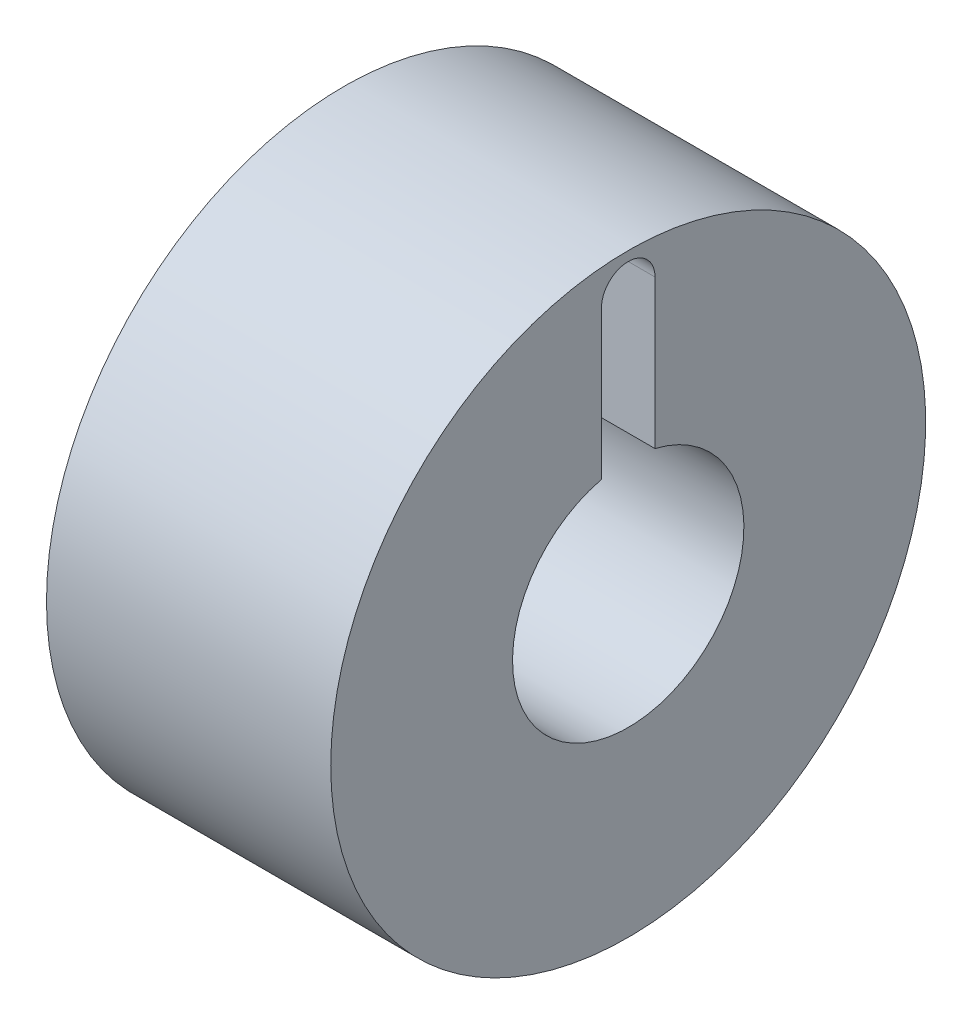
ISO-10303-21;
HEADER;
FILE_DESCRIPTION(('STEP AP214'),'2;1');
FILE_NAME('part.step','',(''),(''),'','','');
FILE_SCHEMA(('AUTOMOTIVE_DESIGN { 1 0 10303 214 1 1 1 1 }'));
ENDSEC;
DATA;
#1=APPLICATION_CONTEXT('core data for automotive mechanical design processes');
#2=APPLICATION_PROTOCOL_DEFINITION('international standard','automotive_design',2000,#1);
#3=PRODUCT_CONTEXT('',#1,'mechanical');
#4=PRODUCT('Part','Part','',(#3));
#5=PRODUCT_RELATED_PRODUCT_CATEGORY('part','',(#4));
#6=PRODUCT_DEFINITION_FORMATION('','',#4);
#7=PRODUCT_DEFINITION_CONTEXT('part definition',#1,'design');
#8=PRODUCT_DEFINITION('design','',#6,#7);
#9=PRODUCT_DEFINITION_SHAPE('','',#8);
#10=(LENGTH_UNIT() NAMED_UNIT(*) SI_UNIT(.MILLI.,.METRE.));
#11=(NAMED_UNIT(*) PLANE_ANGLE_UNIT() SI_UNIT($,.RADIAN.));
#12=(NAMED_UNIT(*) SI_UNIT($,.STERADIAN.) SOLID_ANGLE_UNIT());
#13=UNCERTAINTY_MEASURE_WITH_UNIT(LENGTH_MEASURE(1.E-05),#10,'distance_accuracy_value','');
#14=(GEOMETRIC_REPRESENTATION_CONTEXT(3) GLOBAL_UNCERTAINTY_ASSIGNED_CONTEXT((#13)) GLOBAL_UNIT_ASSIGNED_CONTEXT((#10,
#11,#12)) REPRESENTATION_CONTEXT('',''));
#15=CARTESIAN_POINT('',(0.,0.,0.));
#16=DIRECTION('',(0.,0.,1.));
#17=DIRECTION('',(1.,0.,0.));
#18=AXIS2_PLACEMENT_3D('',#15,#16,#17);
#19=CARTESIAN_POINT('',(227.370475165962,-148.573704322227,0.));
#20=DIRECTION('',(-1.,0.,0.));
#21=DIRECTION('',(0.,0.,1.));
#22=AXIS2_PLACEMENT_3D('',#19,#20,#21);
#23=CYLINDRICAL_SURFACE('',#22,3.5);
#24=CARTESIAN_POINT('',(259.285153787935,-148.573704322227,0.));
#25=DIRECTION('',(-1.,0.,0.));
#26=DIRECTION('',(0.,0.,1.));
#27=AXIS2_PLACEMENT_3D('',#24,#25,#26);
#28=CIRCLE('',#27,3.5);
#29=CARTESIAN_POINT('',(259.285153787935,-145.168724113144,-0.810006034394593));
#30=VERTEX_POINT('',#29);
#31=CARTESIAN_POINT('',(259.285153787935,-145.168724113144,0.810006034394646));
#32=VERTEX_POINT('',#31);
#33=EDGE_CURVE('E11',#30,#32,#28,.T.);
#34=ORIENTED_EDGE('',*,*,#33,.F.);
#35=DIRECTION('',(-1.,0.,0.));
#36=VECTOR('',#35,1.);
#37=CARTESIAN_POINT('',(227.370475165962,-145.168724113144,-0.810006034394644));
#38=LINE('',#37,#36);
#39=CARTESIAN_POINT('',(253.385153787935,-145.168724113144,-0.810006034394593));
#40=VERTEX_POINT('',#39);
#41=EDGE_CURVE('E103',#40,#30,#38,.F.);
#42=ORIENTED_EDGE('',*,*,#41,.F.);
#43=CARTESIAN_POINT('',(253.385153787935,-148.573704322227,0.));
#44=DIRECTION('',(-1.,0.,0.));
#45=DIRECTION('',(0.,0.,1.));
#46=AXIS2_PLACEMENT_3D('',#43,#44,#45);
#47=CIRCLE('',#46,3.5);
#48=CARTESIAN_POINT('',(253.385153787935,-145.168724113144,0.810006034394592));
#49=VERTEX_POINT('',#48);
#50=EDGE_CURVE('E102',#40,#49,#47,.T.);
#51=ORIENTED_EDGE('',*,*,#50,.T.);
#52=DIRECTION('',(-1.,0.,0.));
#53=VECTOR('',#52,1.);
#54=CARTESIAN_POINT('',(227.370475165962,-145.168724113144,0.810006034394592));
#55=LINE('',#54,#53);
#56=EDGE_CURVE('E51',#32,#49,#55,.T.);
#57=ORIENTED_EDGE('',*,*,#56,.F.);
#58=EDGE_LOOP('',(#34,#42,#51,#57));
#59=FACE_BOUND('',#58,.T.);
#60=ADVANCED_FACE('F37',(#59),#23,.F.);
#61=CARTESIAN_POINT('',(259.285153787935,0.,0.));
#62=DIRECTION('',(-1.,0.,0.));
#63=DIRECTION('',(0.,0.,1.));
#64=AXIS2_PLACEMENT_3D('',#61,#62,#63);
#65=PLANE('',#64);
#66=CARTESIAN_POINT('',(259.285153787935,-148.573704322227,0.));
#67=DIRECTION('',(-1.,0.,0.));
#68=DIRECTION('',(0.,0.,1.));
#69=AXIS2_PLACEMENT_3D('',#66,#67,#68);
#70=CIRCLE('',#69,9.00000000000001);
#71=CARTESIAN_POINT('',(259.285153787935,-148.573704322227,9.00000000000001));
#72=VERTEX_POINT('',#71);
#73=EDGE_CURVE('E44',#72,#72,#70,.T.);
#74=ORIENTED_EDGE('',*,*,#73,.F.);
#75=EDGE_LOOP('',(#74));
#76=FACE_BOUND('',#75,.T.);
#77=CARTESIAN_POINT('',(259.285153787935,-140.673704322227,0.));
#78=DIRECTION('',(1.,0.,0.));
#79=DIRECTION('',(0.,0.,-1.));
#80=AXIS2_PLACEMENT_3D('',#77,#78,#79);
#81=CIRCLE('',#80,0.810006034394593);
#82=CARTESIAN_POINT('',(259.285153787935,-140.673704322227,-0.810006034394593));
#83=VERTEX_POINT('',#82);
#84=CARTESIAN_POINT('',(259.285153787935,-140.673704322227,0.810006034394593));
#85=VERTEX_POINT('',#84);
#86=EDGE_CURVE('E95',#83,#85,#81,.T.);
#87=ORIENTED_EDGE('',*,*,#86,.F.);
#88=DIRECTION('',(0.,1.,0.));
#89=VECTOR('',#88,1.);
#90=CARTESIAN_POINT('',(259.285153787935,-140.673704322227,-0.810006034394593));
#91=LINE('',#90,#89);
#92=EDGE_CURVE('E94',#30,#83,#91,.T.);
#93=ORIENTED_EDGE('',*,*,#92,.F.);
#94=ORIENTED_EDGE('',*,*,#33,.T.);
#95=DIRECTION('',(0.,-1.,0.));
#96=VECTOR('',#95,1.);
#97=CARTESIAN_POINT('',(259.285153787935,-140.673704322227,0.810006034394593));
#98=LINE('',#97,#96);
#99=EDGE_CURVE('E87',#85,#32,#98,.T.);
#100=ORIENTED_EDGE('',*,*,#99,.F.);
#101=EDGE_LOOP('',(#87,#93,#94,#100));
#102=FACE_BOUND('',#101,.T.);
#103=ADVANCED_FACE('F106',(#76,#102),#65,.F.);
#104=CARTESIAN_POINT('',(227.370475165962,-148.573704322227,0.));
#105=DIRECTION('',(-1.,0.,0.));
#106=DIRECTION('',(0.,0.,1.));
#107=AXIS2_PLACEMENT_3D('',#104,#105,#106);
#108=CYLINDRICAL_SURFACE('',#107,9.00000000000001);
#109=ORIENTED_EDGE('',*,*,#73,.T.);
#110=EDGE_LOOP('',(#109));
#111=FACE_BOUND('',#110,.T.);
#112=CARTESIAN_POINT('',(250.685153787935,-148.573704322227,0.));
#113=DIRECTION('',(-1.,0.,0.));
#114=DIRECTION('',(0.,0.,1.));
#115=AXIS2_PLACEMENT_3D('',#112,#113,#114);
#116=CIRCLE('',#115,9.00000000000001);
#117=CARTESIAN_POINT('',(250.685153787935,-148.573704322227,9.00000000000001));
#118=VERTEX_POINT('',#117);
#119=EDGE_CURVE('E127',#118,#118,#116,.T.);
#120=ORIENTED_EDGE('',*,*,#119,.F.);
#121=EDGE_LOOP('',(#120));
#122=FACE_BOUND('',#121,.T.);
#123=ADVANCED_FACE('F132',(#111,#122),#108,.T.);
#124=CARTESIAN_POINT('',(250.685153787935,0.,0.));
#125=DIRECTION('',(1.,0.,0.));
#126=DIRECTION('',(0.,0.,-1.));
#127=AXIS2_PLACEMENT_3D('',#124,#125,#126);
#128=PLANE('',#127);
#129=CARTESIAN_POINT('',(250.685153787935,-148.573704322227,0.));
#130=DIRECTION('',(-1.,0.,0.));
#131=DIRECTION('',(0.,0.,1.));
#132=AXIS2_PLACEMENT_3D('',#129,#130,#131);
#133=CIRCLE('',#132,7.70000000000001);
#134=CARTESIAN_POINT('',(250.685153787935,-140.916427376455,-0.810006034394593));
#135=VERTEX_POINT('',#134);
#136=CARTESIAN_POINT('',(250.685153787935,-140.916427376455,0.810006034394593));
#137=VERTEX_POINT('',#136);
#138=EDGE_CURVE('E124',#135,#137,#133,.T.);
#139=ORIENTED_EDGE('',*,*,#138,.F.);
#140=DIRECTION('',(0.,-1.,0.));
#141=VECTOR('',#140,1.);
#142=CARTESIAN_POINT('',(250.685153787935,-140.673704322227,-0.810006034394593));
#143=LINE('',#142,#141);
#144=CARTESIAN_POINT('',(250.685153787935,-140.673704322227,-0.810006034394593));
#145=VERTEX_POINT('',#144);
#146=EDGE_CURVE('E59',#145,#135,#143,.T.);
#147=ORIENTED_EDGE('',*,*,#146,.F.);
#148=CARTESIAN_POINT('',(250.685153787935,-140.673704322227,0.));
#149=DIRECTION('',(1.,0.,0.));
#150=DIRECTION('',(0.,0.,-1.));
#151=AXIS2_PLACEMENT_3D('',#148,#149,#150);
#152=CIRCLE('',#151,0.810006034394593);
#153=CARTESIAN_POINT('',(250.685153787935,-140.673704322227,0.810006034394593));
#154=VERTEX_POINT('',#153);
#155=EDGE_CURVE('E219',#154,#145,#152,.F.);
#156=ORIENTED_EDGE('',*,*,#155,.F.);
#157=DIRECTION('',(0.,1.,0.));
#158=VECTOR('',#157,1.);
#159=CARTESIAN_POINT('',(250.685153787935,-140.673704322227,0.810006034394593));
#160=LINE('',#159,#158);
#161=EDGE_CURVE('E118',#137,#154,#160,.T.);
#162=ORIENTED_EDGE('',*,*,#161,.F.);
#163=EDGE_LOOP('',(#139,#147,#156,#162));
#164=FACE_BOUND('',#163,.T.);
#165=ORIENTED_EDGE('',*,*,#119,.T.);
#166=EDGE_LOOP('',(#165));
#167=FACE_BOUND('',#166,.T.);
#168=ADVANCED_FACE('F140',(#164,#167),#128,.F.);
#169=CARTESIAN_POINT('',(227.370475165962,-148.573704322227,0.));
#170=DIRECTION('',(-1.,0.,0.));
#171=DIRECTION('',(0.,0.,1.));
#172=AXIS2_PLACEMENT_3D('',#169,#170,#171);
#173=CYLINDRICAL_SURFACE('',#172,7.70000000000001);
#174=CARTESIAN_POINT('',(253.385153787935,-148.573704322227,0.));
#175=DIRECTION('',(-1.,0.,0.));
#176=DIRECTION('',(0.,0.,1.));
#177=AXIS2_PLACEMENT_3D('',#174,#175,#176);
#178=CIRCLE('',#177,7.70000000000001);
#179=CARTESIAN_POINT('',(253.385153787935,-140.916427376455,-0.810006034394593));
#180=VERTEX_POINT('',#179);
#181=CARTESIAN_POINT('',(253.385153787935,-140.916427376455,0.810006034394593));
#182=VERTEX_POINT('',#181);
#183=EDGE_CURVE('E121',#180,#182,#178,.T.);
#184=ORIENTED_EDGE('',*,*,#183,.F.);
#185=DIRECTION('',(-1.,0.,0.));
#186=VECTOR('',#185,1.);
#187=CARTESIAN_POINT('',(227.370475165962,-140.916427376455,-0.810006034394593));
#188=LINE('',#187,#186);
#189=EDGE_CURVE('E221',#135,#180,#188,.F.);
#190=ORIENTED_EDGE('',*,*,#189,.F.);
#191=ORIENTED_EDGE('',*,*,#138,.T.);
#192=DIRECTION('',(-1.,0.,0.));
#193=VECTOR('',#192,1.);
#194=CARTESIAN_POINT('',(227.370475165962,-140.916427376455,0.810006034394593));
#195=LINE('',#194,#193);
#196=EDGE_CURVE('E116',#182,#137,#195,.T.);
#197=ORIENTED_EDGE('',*,*,#196,.F.);
#198=EDGE_LOOP('',(#184,#190,#191,#197));
#199=FACE_BOUND('',#198,.T.);
#200=ADVANCED_FACE('F145',(#199),#173,.F.);
#201=CARTESIAN_POINT('',(253.385153787935,0.,0.));
#202=DIRECTION('',(-1.,0.,0.));
#203=DIRECTION('',(0.,0.,1.));
#204=AXIS2_PLACEMENT_3D('',#201,#202,#203);
#205=PLANE('',#204);
#206=DIRECTION('',(0.,1.,0.));
#207=VECTOR('',#206,1.);
#208=CARTESIAN_POINT('',(253.385153787935,-140.673704322227,-0.810006034394593));
#209=LINE('',#208,#207);
#210=EDGE_CURVE('E228',#40,#180,#209,.T.);
#211=ORIENTED_EDGE('',*,*,#210,.T.);
#212=ORIENTED_EDGE('',*,*,#183,.T.);
#213=DIRECTION('',(0.,-1.,0.));
#214=VECTOR('',#213,1.);
#215=CARTESIAN_POINT('',(253.385153787935,-140.673704322227,0.810006034394593));
#216=LINE('',#215,#214);
#217=EDGE_CURVE('E113',#182,#49,#216,.T.);
#218=ORIENTED_EDGE('',*,*,#217,.T.);
#219=ORIENTED_EDGE('',*,*,#50,.F.);
#220=EDGE_LOOP('',(#211,#212,#218,#219));
#221=FACE_BOUND('',#220,.T.);
#222=ADVANCED_FACE('F149',(#221),#205,.T.);
#223=CARTESIAN_POINT('',(250.684153787935,-140.673704322227,0.));
#224=DIRECTION('',(1.,0.,0.));
#225=DIRECTION('',(0.,0.,-1.));
#226=AXIS2_PLACEMENT_3D('',#223,#224,#225);
#227=CYLINDRICAL_SURFACE('',#226,0.810006034394593);
#228=ORIENTED_EDGE('',*,*,#155,.T.);
#229=DIRECTION('',(1.,0.,0.));
#230=VECTOR('',#229,1.);
#231=CARTESIAN_POINT('',(250.684153787935,-140.673704322227,-0.810006034394593));
#232=LINE('',#231,#230);
#233=EDGE_CURVE('E109',#145,#83,#232,.T.);
#234=ORIENTED_EDGE('',*,*,#233,.T.);
#235=ORIENTED_EDGE('',*,*,#86,.T.);
#236=DIRECTION('',(1.,0.,0.));
#237=VECTOR('',#236,1.);
#238=CARTESIAN_POINT('',(250.684153787935,-140.673704322227,0.810006034394593));
#239=LINE('',#238,#237);
#240=EDGE_CURVE('E90',#154,#85,#239,.T.);
#241=ORIENTED_EDGE('',*,*,#240,.F.);
#242=EDGE_LOOP('',(#228,#234,#235,#241));
#243=FACE_BOUND('',#242,.T.);
#244=ADVANCED_FACE('F153',(#243),#227,.F.);
#245=CARTESIAN_POINT('',(250.684153787935,-140.673704322227,-0.810006034394593));
#246=DIRECTION('',(0.,0.,-1.));
#247=DIRECTION('',(0.,1.,0.));
#248=AXIS2_PLACEMENT_3D('',#245,#246,#247);
#249=PLANE('',#248);
#250=ORIENTED_EDGE('',*,*,#146,.T.);
#251=ORIENTED_EDGE('',*,*,#189,.T.);
#252=ORIENTED_EDGE('',*,*,#210,.F.);
#253=ORIENTED_EDGE('',*,*,#41,.T.);
#254=ORIENTED_EDGE('',*,*,#92,.T.);
#255=ORIENTED_EDGE('',*,*,#233,.F.);
#256=EDGE_LOOP('',(#250,#251,#252,#253,#254,#255));
#257=FACE_BOUND('',#256,.T.);
#258=ADVANCED_FACE('F157',(#257),#249,.F.);
#259=CARTESIAN_POINT('',(250.684153787935,-140.673704322227,0.810006034394593));
#260=DIRECTION('',(0.,0.,1.));
#261=DIRECTION('',(0.,-1.,0.));
#262=AXIS2_PLACEMENT_3D('',#259,#260,#261);
#263=PLANE('',#262);
#264=ORIENTED_EDGE('',*,*,#161,.T.);
#265=ORIENTED_EDGE('',*,*,#240,.T.);
#266=ORIENTED_EDGE('',*,*,#99,.T.);
#267=ORIENTED_EDGE('',*,*,#56,.T.);
#268=ORIENTED_EDGE('',*,*,#217,.F.);
#269=ORIENTED_EDGE('',*,*,#196,.T.);
#270=EDGE_LOOP('',(#264,#265,#266,#267,#268,#269));
#271=FACE_BOUND('',#270,.T.);
#272=ADVANCED_FACE('F89',(#271),#263,.F.);
#273=CLOSED_SHELL('',(#60,#103,#123,#168,#200,#222,#244,#258,#272));
#274=MANIFOLD_SOLID_BREP('B2',#273);
#275=ADVANCED_BREP_SHAPE_REPRESENTATION('',(#18,#274),#14);
#276=SHAPE_DEFINITION_REPRESENTATION(#9,#275);
ENDSEC;
END-ISO-10303-21;
